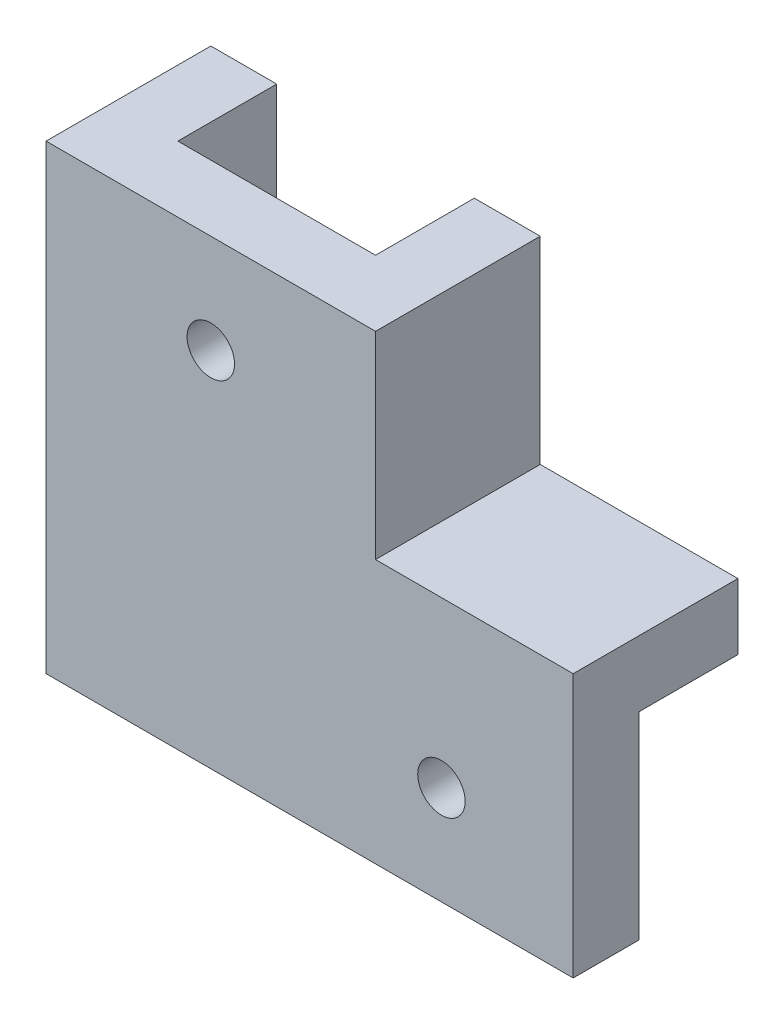
ISO-10303-21;
HEADER;
FILE_DESCRIPTION(('STEP AP214'),'2;1');
FILE_NAME('part.step','',(''),(''),'','','');
FILE_SCHEMA(('AUTOMOTIVE_DESIGN { 1 0 10303 214 1 1 1 1 }'));
ENDSEC;
DATA;
#1=APPLICATION_CONTEXT('core data for automotive mechanical design processes');
#2=APPLICATION_PROTOCOL_DEFINITION('international standard','automotive_design',2000,#1);
#3=PRODUCT_CONTEXT('',#1,'mechanical');
#4=PRODUCT('Part','Part','',(#3));
#5=PRODUCT_RELATED_PRODUCT_CATEGORY('part','',(#4));
#6=PRODUCT_DEFINITION_FORMATION('','',#4);
#7=PRODUCT_DEFINITION_CONTEXT('part definition',#1,'design');
#8=PRODUCT_DEFINITION('design','',#6,#7);
#9=PRODUCT_DEFINITION_SHAPE('','',#8);
#10=(LENGTH_UNIT() NAMED_UNIT(*) SI_UNIT(.MILLI.,.METRE.));
#11=(NAMED_UNIT(*) PLANE_ANGLE_UNIT() SI_UNIT($,.RADIAN.));
#12=(NAMED_UNIT(*) SI_UNIT($,.STERADIAN.) SOLID_ANGLE_UNIT());
#13=UNCERTAINTY_MEASURE_WITH_UNIT(LENGTH_MEASURE(1.E-05),#10,'distance_accuracy_value','');
#14=(GEOMETRIC_REPRESENTATION_CONTEXT(3) GLOBAL_UNCERTAINTY_ASSIGNED_CONTEXT((#13)) GLOBAL_UNIT_ASSIGNED_CONTEXT((#10,
#11,#12)) REPRESENTATION_CONTEXT('',''));
#15=CARTESIAN_POINT('',(0.,0.,0.));
#16=DIRECTION('',(0.,0.,1.));
#17=DIRECTION('',(1.,0.,0.));
#18=AXIS2_PLACEMENT_3D('',#15,#16,#17);
#19=CARTESIAN_POINT('',(7.47011952191236,-10.8067729083665,-7.5));
#20=DIRECTION('',(1.,0.,0.));
#21=DIRECTION('',(0.,1.,0.));
#22=AXIS2_PLACEMENT_3D('',#19,#20,#21);
#23=PLANE('',#22);
#24=DIRECTION('',(0.,1.,0.));
#25=VECTOR('',#24,1.);
#26=CARTESIAN_POINT('',(7.47011952191236,9.19322709163348,0.));
#27=LINE('',#26,#25);
#28=CARTESIAN_POINT('',(7.47011952191236,-10.8067729083665,0.));
#29=VERTEX_POINT('',#28);
#30=CARTESIAN_POINT('',(7.47011952191236,9.19322709163348,0.));
#31=VERTEX_POINT('',#30);
#32=EDGE_CURVE('E180',#29,#31,#27,.T.);
#33=ORIENTED_EDGE('',*,*,#32,.T.);
#34=DIRECTION('',(0.,0.,1.));
#35=VECTOR('',#34,1.);
#36=CARTESIAN_POINT('',(7.47011952191236,9.19322709163348,-7.5));
#37=LINE('',#36,#35);
#38=CARTESIAN_POINT('',(7.47011952191236,9.19322709163348,-7.5));
#39=VERTEX_POINT('',#38);
#40=EDGE_CURVE('E11',#39,#31,#37,.T.);
#41=ORIENTED_EDGE('',*,*,#40,.F.);
#42=DIRECTION('',(0.,1.,0.));
#43=VECTOR('',#42,1.);
#44=CARTESIAN_POINT('',(7.47011952191236,-10.8067729083665,-7.5));
#45=LINE('',#44,#43);
#46=CARTESIAN_POINT('',(7.47011952191236,-10.8067729083665,-7.5));
#47=VERTEX_POINT('',#46);
#48=EDGE_CURVE('E205',#47,#39,#45,.T.);
#49=ORIENTED_EDGE('',*,*,#48,.F.);
#50=DIRECTION('',(0.,0.,1.));
#51=VECTOR('',#50,1.);
#52=CARTESIAN_POINT('',(7.47011952191236,-10.8067729083665,-7.5));
#53=LINE('',#52,#51);
#54=EDGE_CURVE('E221',#47,#29,#53,.T.);
#55=ORIENTED_EDGE('',*,*,#54,.T.);
#56=EDGE_LOOP('',(#33,#41,#49,#55));
#57=FACE_BOUND('',#56,.T.);
#58=ADVANCED_FACE('F39',(#57),#23,.F.);
#59=CARTESIAN_POINT('',(27.4701195219124,-10.8067729083665,-7.5));
#60=DIRECTION('',(0.,1.,0.));
#61=DIRECTION('',(-1.,0.,0.));
#62=AXIS2_PLACEMENT_3D('',#59,#60,#61);
#63=PLANE('',#62);
#64=DIRECTION('',(-1.,0.,0.));
#65=VECTOR('',#64,1.);
#66=CARTESIAN_POINT('',(27.4701195219124,-10.8067729083665,0.));
#67=LINE('',#66,#65);
#68=CARTESIAN_POINT('',(27.4701195219124,-10.8067729083665,0.));
#69=VERTEX_POINT('',#68);
#70=EDGE_CURVE('E176',#69,#29,#67,.T.);
#71=ORIENTED_EDGE('',*,*,#70,.T.);
#72=ORIENTED_EDGE('',*,*,#54,.F.);
#73=DIRECTION('',(-1.,0.,0.));
#74=VECTOR('',#73,1.);
#75=CARTESIAN_POINT('',(27.4701195219124,-10.8067729083665,-7.5));
#76=LINE('',#75,#74);
#77=CARTESIAN_POINT('',(27.4701195219124,-10.8067729083665,-7.5));
#78=VERTEX_POINT('',#77);
#79=EDGE_CURVE('E54',#78,#47,#76,.T.);
#80=ORIENTED_EDGE('',*,*,#79,.F.);
#81=DIRECTION('',(0.,0.,1.));
#82=VECTOR('',#81,1.);
#83=CARTESIAN_POINT('',(27.4701195219124,-10.8067729083665,-7.5));
#84=LINE('',#83,#82);
#85=EDGE_CURVE('E225',#78,#69,#84,.T.);
#86=ORIENTED_EDGE('',*,*,#85,.T.);
#87=EDGE_LOOP('',(#71,#72,#80,#86));
#88=FACE_BOUND('',#87,.T.);
#89=ADVANCED_FACE('F259',(#88),#63,.F.);
#90=CARTESIAN_POINT('',(7.47011952191236,9.19322709163348,-7.5));
#91=DIRECTION('',(0.,-1.,0.));
#92=DIRECTION('',(0.,0.,-1.));
#93=AXIS2_PLACEMENT_3D('',#90,#91,#92);
#94=PLANE('',#93);
#95=ORIENTED_EDGE('',*,*,#40,.T.);
#96=DIRECTION('',(-1.,0.,0.));
#97=VECTOR('',#96,1.);
#98=CARTESIAN_POINT('',(-7.52988047808764,9.19322709163348,0.));
#99=LINE('',#98,#97);
#100=CARTESIAN_POINT('',(-7.52988047808764,9.19322709163348,0.));
#101=VERTEX_POINT('',#100);
#102=EDGE_CURVE('E170',#31,#101,#99,.T.);
#103=ORIENTED_EDGE('',*,*,#102,.T.);
#104=DIRECTION('',(0.,0.,1.));
#105=VECTOR('',#104,1.);
#106=CARTESIAN_POINT('',(-7.52988047808764,9.19322709163348,-7.5));
#107=LINE('',#106,#105);
#108=CARTESIAN_POINT('',(-7.52988047808764,9.19322709163348,-7.5));
#109=VERTEX_POINT('',#108);
#110=EDGE_CURVE('E150',#109,#101,#107,.T.);
#111=ORIENTED_EDGE('',*,*,#110,.F.);
#112=DIRECTION('',(1.,0.,0.));
#113=VECTOR('',#112,1.);
#114=CARTESIAN_POINT('',(-7.52988047808764,9.19322709163348,-7.5));
#115=LINE('',#114,#113);
#116=CARTESIAN_POINT('',(-12.5298804780876,9.19322709163348,-7.5));
#117=VERTEX_POINT('',#116);
#118=EDGE_CURVE('E140',#117,#109,#115,.T.);
#119=ORIENTED_EDGE('',*,*,#118,.F.);
#120=DIRECTION('',(0.,0.,-1.));
#121=VECTOR('',#120,1.);
#122=CARTESIAN_POINT('',(-12.5298804780876,9.19322709163348,5.));
#123=LINE('',#122,#121);
#124=CARTESIAN_POINT('',(-12.5298804780876,9.19322709163348,5.));
#125=VERTEX_POINT('',#124);
#126=EDGE_CURVE('E155',#125,#117,#123,.T.);
#127=ORIENTED_EDGE('',*,*,#126,.F.);
#128=DIRECTION('',(-1.,0.,0.));
#129=VECTOR('',#128,1.);
#130=CARTESIAN_POINT('',(12.4701195219124,9.19322709163348,5.));
#131=LINE('',#130,#129);
#132=CARTESIAN_POINT('',(12.4701195219124,9.19322709163348,5.));
#133=VERTEX_POINT('',#132);
#134=EDGE_CURVE('E190',#133,#125,#131,.T.);
#135=ORIENTED_EDGE('',*,*,#134,.F.);
#136=DIRECTION('',(0.,0.,1.));
#137=VECTOR('',#136,1.);
#138=CARTESIAN_POINT('',(12.4701195219124,9.19322709163348,-7.5));
#139=LINE('',#138,#137);
#140=CARTESIAN_POINT('',(12.4701195219124,9.19322709163348,-7.5));
#141=VERTEX_POINT('',#140);
#142=EDGE_CURVE('E47',#141,#133,#139,.T.);
#143=ORIENTED_EDGE('',*,*,#142,.F.);
#144=DIRECTION('',(1.,0.,0.));
#145=VECTOR('',#144,1.);
#146=CARTESIAN_POINT('',(7.47011952191236,9.19322709163348,-7.5));
#147=LINE('',#146,#145);
#148=EDGE_CURVE('E208',#39,#141,#147,.T.);
#149=ORIENTED_EDGE('',*,*,#148,.F.);
#150=EDGE_LOOP('',(#95,#103,#111,#119,#127,#135,#143,#149));
#151=FACE_BOUND('',#150,.T.);
#152=ADVANCED_FACE('F247',(#151),#94,.F.);
#153=CARTESIAN_POINT('',(12.4701195219124,9.19322709163348,-7.5));
#154=DIRECTION('',(-1.,0.,0.));
#155=DIRECTION('',(0.,-1.,0.));
#156=AXIS2_PLACEMENT_3D('',#153,#154,#155);
#157=PLANE('',#156);
#158=ORIENTED_EDGE('',*,*,#142,.T.);
#159=DIRECTION('',(0.,1.,0.));
#160=VECTOR('',#159,1.);
#161=CARTESIAN_POINT('',(12.4701195219124,-5.80677290836653,5.));
#162=LINE('',#161,#160);
#163=CARTESIAN_POINT('',(12.4701195219124,-5.80677290836653,5.));
#164=VERTEX_POINT('',#163);
#165=EDGE_CURVE('E201',#164,#133,#162,.T.);
#166=ORIENTED_EDGE('',*,*,#165,.F.);
#167=DIRECTION('',(0.,0.,1.));
#168=VECTOR('',#167,1.);
#169=CARTESIAN_POINT('',(12.4701195219124,-5.80677290836653,-7.5));
#170=LINE('',#169,#168);
#171=CARTESIAN_POINT('',(12.4701195219124,-5.80677290836653,-7.5));
#172=VERTEX_POINT('',#171);
#173=EDGE_CURVE('E232',#172,#164,#170,.T.);
#174=ORIENTED_EDGE('',*,*,#173,.F.);
#175=DIRECTION('',(0.,-1.,0.));
#176=VECTOR('',#175,1.);
#177=CARTESIAN_POINT('',(12.4701195219124,9.19322709163348,-7.5));
#178=LINE('',#177,#176);
#179=EDGE_CURVE('E211',#141,#172,#178,.T.);
#180=ORIENTED_EDGE('',*,*,#179,.F.);
#181=EDGE_LOOP('',(#158,#166,#174,#180));
#182=FACE_BOUND('',#181,.T.);
#183=ADVANCED_FACE('F239',(#182),#157,.F.);
#184=CARTESIAN_POINT('',(12.4701195219124,-5.80677290836653,-7.5));
#185=DIRECTION('',(0.,-1.,0.));
#186=DIRECTION('',(1.,0.,0.));
#187=AXIS2_PLACEMENT_3D('',#184,#185,#186);
#188=PLANE('',#187);
#189=ORIENTED_EDGE('',*,*,#173,.T.);
#190=DIRECTION('',(-1.,0.,0.));
#191=VECTOR('',#190,1.);
#192=CARTESIAN_POINT('',(27.4701195219124,-5.80677290836653,5.));
#193=LINE('',#192,#191);
#194=CARTESIAN_POINT('',(27.4701195219124,-5.80677290836653,5.));
#195=VERTEX_POINT('',#194);
#196=EDGE_CURVE('E197',#195,#164,#193,.T.);
#197=ORIENTED_EDGE('',*,*,#196,.F.);
#198=DIRECTION('',(0.,0.,1.));
#199=VECTOR('',#198,1.);
#200=CARTESIAN_POINT('',(27.4701195219124,-5.80677290836653,-7.5));
#201=LINE('',#200,#199);
#202=CARTESIAN_POINT('',(27.4701195219124,-5.80677290836653,-7.5));
#203=VERTEX_POINT('',#202);
#204=EDGE_CURVE('E229',#203,#195,#201,.T.);
#205=ORIENTED_EDGE('',*,*,#204,.F.);
#206=DIRECTION('',(1.,0.,0.));
#207=VECTOR('',#206,1.);
#208=CARTESIAN_POINT('',(12.4701195219124,-5.80677290836653,-7.5));
#209=LINE('',#208,#207);
#210=EDGE_CURVE('E214',#172,#203,#209,.T.);
#211=ORIENTED_EDGE('',*,*,#210,.F.);
#212=EDGE_LOOP('',(#189,#197,#205,#211));
#213=FACE_BOUND('',#212,.T.);
#214=ADVANCED_FACE('F263',(#213),#188,.F.);
#215=CARTESIAN_POINT('',(27.4701195219124,-10.8067729083665,-7.5));
#216=DIRECTION('',(-1.,0.,0.));
#217=DIRECTION('',(0.,0.,1.));
#218=AXIS2_PLACEMENT_3D('',#215,#216,#217);
#219=PLANE('',#218);
#220=ORIENTED_EDGE('',*,*,#204,.T.);
#221=DIRECTION('',(0.,1.,0.));
#222=VECTOR('',#221,1.);
#223=CARTESIAN_POINT('',(27.4701195219124,-10.8067729083665,5.));
#224=LINE('',#223,#222);
#225=CARTESIAN_POINT('',(27.4701195219124,-25.8067729083665,5.));
#226=VERTEX_POINT('',#225);
#227=EDGE_CURVE('E193',#226,#195,#224,.T.);
#228=ORIENTED_EDGE('',*,*,#227,.F.);
#229=DIRECTION('',(0.,0.,-1.));
#230=VECTOR('',#229,1.);
#231=CARTESIAN_POINT('',(27.4701195219124,-25.8067729083665,5.));
#232=LINE('',#231,#230);
#233=CARTESIAN_POINT('',(27.4701195219124,-25.8067729083665,0.));
#234=VERTEX_POINT('',#233);
#235=EDGE_CURVE('E169',#226,#234,#232,.T.);
#236=ORIENTED_EDGE('',*,*,#235,.T.);
#237=DIRECTION('',(0.,1.,0.));
#238=VECTOR('',#237,1.);
#239=CARTESIAN_POINT('',(27.4701195219124,-25.8067729083665,0.));
#240=LINE('',#239,#238);
#241=EDGE_CURVE('E173',#234,#69,#240,.T.);
#242=ORIENTED_EDGE('',*,*,#241,.T.);
#243=ORIENTED_EDGE('',*,*,#85,.F.);
#244=DIRECTION('',(0.,-1.,0.));
#245=VECTOR('',#244,1.);
#246=CARTESIAN_POINT('',(27.4701195219124,-10.8067729083665,-7.5));
#247=LINE('',#246,#245);
#248=EDGE_CURVE('E59',#203,#78,#247,.T.);
#249=ORIENTED_EDGE('',*,*,#248,.F.);
#250=EDGE_LOOP('',(#220,#228,#236,#242,#243,#249));
#251=FACE_BOUND('',#250,.T.);
#252=ADVANCED_FACE('F254',(#251),#219,.F.);
#253=CARTESIAN_POINT('',(0.,0.,-7.5));
#254=DIRECTION('',(0.,0.,-1.));
#255=DIRECTION('',(-1.,0.,0.));
#256=AXIS2_PLACEMENT_3D('',#253,#254,#255);
#257=PLANE('',#256);
#258=ORIENTED_EDGE('',*,*,#48,.T.);
#259=ORIENTED_EDGE('',*,*,#148,.T.);
#260=ORIENTED_EDGE('',*,*,#179,.T.);
#261=ORIENTED_EDGE('',*,*,#210,.T.);
#262=ORIENTED_EDGE('',*,*,#248,.T.);
#263=ORIENTED_EDGE('',*,*,#79,.T.);
#264=EDGE_LOOP('',(#258,#259,#260,#261,#262,#263));
#265=FACE_BOUND('',#264,.T.);
#266=ADVANCED_FACE('F264',(#265),#257,.T.);
#267=CARTESIAN_POINT('',(0.,0.,5.));
#268=DIRECTION('',(0.,0.,1.));
#269=DIRECTION('',(1.,0.,0.));
#270=AXIS2_PLACEMENT_3D('',#267,#268,#269);
#271=PLANE('',#270);
#272=CARTESIAN_POINT('',(-0.0298804780876445,1.69322709163348,5.));
#273=DIRECTION('',(0.,0.,-1.));
#274=DIRECTION('',(-1.,0.,0.));
#275=AXIS2_PLACEMENT_3D('',#272,#273,#274);
#276=CIRCLE('',#275,1.8);
#277=CARTESIAN_POINT('',(-1.82988047808764,1.69322709163348,5.));
#278=VERTEX_POINT('',#277);
#279=EDGE_CURVE('E443',#278,#278,#276,.T.);
#280=ORIENTED_EDGE('',*,*,#279,.T.);
#281=EDGE_LOOP('',(#280));
#282=FACE_BOUND('',#281,.T.);
#283=CARTESIAN_POINT('',(17.4701195219124,-18.3067729083665,5.));
#284=DIRECTION('',(0.,0.,-1.));
#285=DIRECTION('',(-1.,0.,0.));
#286=AXIS2_PLACEMENT_3D('',#283,#284,#285);
#287=CIRCLE('',#286,1.8);
#288=CARTESIAN_POINT('',(15.6701195219124,-18.3067729083665,5.));
#289=VERTEX_POINT('',#288);
#290=EDGE_CURVE('E448',#289,#289,#287,.T.);
#291=ORIENTED_EDGE('',*,*,#290,.T.);
#292=EDGE_LOOP('',(#291));
#293=FACE_BOUND('',#292,.T.);
#294=DIRECTION('',(1.,0.,0.));
#295=VECTOR('',#294,1.);
#296=CARTESIAN_POINT('',(-7.52988047808764,-25.8067729083665,5.));
#297=LINE('',#296,#295);
#298=CARTESIAN_POINT('',(-12.5298804780876,-25.8067729083665,5.));
#299=VERTEX_POINT('',#298);
#300=EDGE_CURVE('E165',#299,#226,#297,.T.);
#301=ORIENTED_EDGE('',*,*,#300,.T.);
#302=ORIENTED_EDGE('',*,*,#227,.T.);
#303=ORIENTED_EDGE('',*,*,#196,.T.);
#304=ORIENTED_EDGE('',*,*,#165,.T.);
#305=ORIENTED_EDGE('',*,*,#134,.T.);
#306=DIRECTION('',(0.,-1.,0.));
#307=VECTOR('',#306,1.);
#308=CARTESIAN_POINT('',(-12.5298804780876,9.19322709163348,5.));
#309=LINE('',#308,#307);
#310=EDGE_CURVE('E149',#125,#299,#309,.T.);
#311=ORIENTED_EDGE('',*,*,#310,.T.);
#312=EDGE_LOOP('',(#301,#302,#303,#304,#305,#311));
#313=FACE_BOUND('',#312,.T.);
#314=ADVANCED_FACE('F244',(#282,#293,#313),#271,.T.);
#315=CARTESIAN_POINT('',(0.,0.,0.));
#316=DIRECTION('',(0.,0.,1.));
#317=DIRECTION('',(1.,0.,0.));
#318=AXIS2_PLACEMENT_3D('',#315,#316,#317);
#319=PLANE('',#318);
#320=CARTESIAN_POINT('',(-0.0298804780876445,1.69322709163348,0.));
#321=DIRECTION('',(0.,0.,-1.));
#322=DIRECTION('',(-1.,0.,0.));
#323=AXIS2_PLACEMENT_3D('',#320,#321,#322);
#324=CIRCLE('',#323,1.8);
#325=CARTESIAN_POINT('',(-1.82988047808764,1.69322709163348,0.));
#326=VERTEX_POINT('',#325);
#327=EDGE_CURVE('E446',#326,#326,#324,.T.);
#328=ORIENTED_EDGE('',*,*,#327,.F.);
#329=EDGE_LOOP('',(#328));
#330=FACE_BOUND('',#329,.T.);
#331=CARTESIAN_POINT('',(17.4701195219124,-18.3067729083665,0.));
#332=DIRECTION('',(0.,0.,-1.));
#333=DIRECTION('',(-1.,0.,0.));
#334=AXIS2_PLACEMENT_3D('',#331,#332,#333);
#335=CIRCLE('',#334,1.8);
#336=CARTESIAN_POINT('',(15.6701195219124,-18.3067729083665,0.));
#337=VERTEX_POINT('',#336);
#338=EDGE_CURVE('E454',#337,#337,#335,.T.);
#339=ORIENTED_EDGE('',*,*,#338,.F.);
#340=EDGE_LOOP('',(#339));
#341=FACE_BOUND('',#340,.T.);
#342=DIRECTION('',(0.,-1.,0.));
#343=VECTOR('',#342,1.);
#344=CARTESIAN_POINT('',(-7.52988047808764,-25.8067729083665,0.));
#345=LINE('',#344,#343);
#346=CARTESIAN_POINT('',(-7.52988047808764,-25.8067729083665,0.));
#347=VERTEX_POINT('',#346);
#348=EDGE_CURVE('E145',#101,#347,#345,.T.);
#349=ORIENTED_EDGE('',*,*,#348,.F.);
#350=ORIENTED_EDGE('',*,*,#102,.F.);
#351=ORIENTED_EDGE('',*,*,#32,.F.);
#352=ORIENTED_EDGE('',*,*,#70,.F.);
#353=ORIENTED_EDGE('',*,*,#241,.F.);
#354=DIRECTION('',(1.,0.,0.));
#355=VECTOR('',#354,1.);
#356=CARTESIAN_POINT('',(-7.52988047808764,-25.8067729083665,0.));
#357=LINE('',#356,#355);
#358=EDGE_CURVE('E164',#347,#234,#357,.T.);
#359=ORIENTED_EDGE('',*,*,#358,.F.);
#360=EDGE_LOOP('',(#349,#350,#351,#352,#353,#359));
#361=FACE_BOUND('',#360,.T.);
#362=ADVANCED_FACE('F257',(#330,#341,#361),#319,.F.);
#363=CARTESIAN_POINT('',(-7.52988047808764,-25.8067729083665,5.));
#364=DIRECTION('',(0.,1.,0.));
#365=DIRECTION('',(0.,0.,1.));
#366=AXIS2_PLACEMENT_3D('',#363,#364,#365);
#367=PLANE('',#366);
#368=DIRECTION('',(0.,0.,-1.));
#369=VECTOR('',#368,1.);
#370=CARTESIAN_POINT('',(-12.5298804780876,-25.8067729083665,5.));
#371=LINE('',#370,#369);
#372=CARTESIAN_POINT('',(-12.5298804780876,-25.8067729083665,-7.5));
#373=VERTEX_POINT('',#372);
#374=EDGE_CURVE('E129',#299,#373,#371,.T.);
#375=ORIENTED_EDGE('',*,*,#374,.T.);
#376=DIRECTION('',(-1.,0.,0.));
#377=VECTOR('',#376,1.);
#378=CARTESIAN_POINT('',(-7.52988047808764,-25.8067729083665,-7.5));
#379=LINE('',#378,#377);
#380=CARTESIAN_POINT('',(-7.52988047808764,-25.8067729083665,-7.5));
#381=VERTEX_POINT('',#380);
#382=EDGE_CURVE('E122',#381,#373,#379,.T.);
#383=ORIENTED_EDGE('',*,*,#382,.F.);
#384=DIRECTION('',(0.,0.,1.));
#385=VECTOR('',#384,1.);
#386=CARTESIAN_POINT('',(-7.52988047808764,-25.8067729083665,-7.5));
#387=LINE('',#386,#385);
#388=EDGE_CURVE('E126',#381,#347,#387,.T.);
#389=ORIENTED_EDGE('',*,*,#388,.T.);
#390=ORIENTED_EDGE('',*,*,#358,.T.);
#391=ORIENTED_EDGE('',*,*,#235,.F.);
#392=ORIENTED_EDGE('',*,*,#300,.F.);
#393=EDGE_LOOP('',(#375,#383,#389,#390,#391,#392));
#394=FACE_BOUND('',#393,.T.);
#395=ADVANCED_FACE('F124',(#394),#367,.F.);
#396=CARTESIAN_POINT('',(-12.5298804780876,9.19322709163348,5.));
#397=DIRECTION('',(1.,0.,0.));
#398=DIRECTION('',(0.,1.,0.));
#399=AXIS2_PLACEMENT_3D('',#396,#397,#398);
#400=PLANE('',#399);
#401=ORIENTED_EDGE('',*,*,#126,.T.);
#402=DIRECTION('',(0.,1.,0.));
#403=VECTOR('',#402,1.);
#404=CARTESIAN_POINT('',(-12.5298804780876,-25.8067729083665,-7.5));
#405=LINE('',#404,#403);
#406=EDGE_CURVE('E134',#373,#117,#405,.T.);
#407=ORIENTED_EDGE('',*,*,#406,.F.);
#408=ORIENTED_EDGE('',*,*,#374,.F.);
#409=ORIENTED_EDGE('',*,*,#310,.F.);
#410=EDGE_LOOP('',(#401,#407,#408,#409));
#411=FACE_BOUND('',#410,.T.);
#412=ADVANCED_FACE('F250',(#411),#400,.F.);
#413=CARTESIAN_POINT('',(-7.52988047808764,-25.8067729083665,-7.5));
#414=DIRECTION('',(-1.,0.,0.));
#415=DIRECTION('',(0.,-1.,0.));
#416=AXIS2_PLACEMENT_3D('',#413,#414,#415);
#417=PLANE('',#416);
#418=ORIENTED_EDGE('',*,*,#348,.T.);
#419=ORIENTED_EDGE('',*,*,#388,.F.);
#420=DIRECTION('',(0.,-1.,0.));
#421=VECTOR('',#420,1.);
#422=CARTESIAN_POINT('',(-7.52988047808764,-25.8067729083665,-7.5));
#423=LINE('',#422,#421);
#424=EDGE_CURVE('E135',#109,#381,#423,.T.);
#425=ORIENTED_EDGE('',*,*,#424,.F.);
#426=ORIENTED_EDGE('',*,*,#110,.T.);
#427=EDGE_LOOP('',(#418,#419,#425,#426));
#428=FACE_BOUND('',#427,.T.);
#429=ADVANCED_FACE('F147',(#428),#417,.F.);
#430=CARTESIAN_POINT('',(0.,0.,-7.5));
#431=DIRECTION('',(0.,0.,1.));
#432=DIRECTION('',(1.,0.,0.));
#433=AXIS2_PLACEMENT_3D('',#430,#431,#432);
#434=PLANE('',#433);
#435=ORIENTED_EDGE('',*,*,#424,.T.);
#436=ORIENTED_EDGE('',*,*,#382,.T.);
#437=ORIENTED_EDGE('',*,*,#406,.T.);
#438=ORIENTED_EDGE('',*,*,#118,.T.);
#439=EDGE_LOOP('',(#435,#436,#437,#438));
#440=FACE_BOUND('',#439,.T.);
#441=ADVANCED_FACE('F138',(#440),#434,.F.);
#442=CARTESIAN_POINT('',(17.4701195219124,-18.3067729083665,5.));
#443=DIRECTION('',(0.,0.,-1.));
#444=DIRECTION('',(-1.,0.,0.));
#445=AXIS2_PLACEMENT_3D('',#442,#443,#444);
#446=CYLINDRICAL_SURFACE('',#445,1.8);
#447=ORIENTED_EDGE('',*,*,#290,.F.);
#448=EDGE_LOOP('',(#447));
#449=FACE_BOUND('',#448,.T.);
#450=ORIENTED_EDGE('',*,*,#338,.T.);
#451=EDGE_LOOP('',(#450));
#452=FACE_BOUND('',#451,.T.);
#453=ADVANCED_FACE('F339',(#449,#452),#446,.F.);
#454=CARTESIAN_POINT('',(-0.0298804780876445,1.69322709163348,5.));
#455=DIRECTION('',(0.,0.,-1.));
#456=DIRECTION('',(-1.,0.,0.));
#457=AXIS2_PLACEMENT_3D('',#454,#455,#456);
#458=CYLINDRICAL_SURFACE('',#457,1.8);
#459=ORIENTED_EDGE('',*,*,#279,.F.);
#460=EDGE_LOOP('',(#459));
#461=FACE_BOUND('',#460,.T.);
#462=ORIENTED_EDGE('',*,*,#327,.T.);
#463=EDGE_LOOP('',(#462));
#464=FACE_BOUND('',#463,.T.);
#465=ADVANCED_FACE('F345',(#461,#464),#458,.F.);
#466=CLOSED_SHELL('',(#58,#89,#152,#183,#214,#252,#266,#314,#362,#395,#412,#429,#441,#453,#465));
#467=MANIFOLD_SOLID_BREP('B2',#466);
#468=ADVANCED_BREP_SHAPE_REPRESENTATION('',(#18,#467),#14);
#469=SHAPE_DEFINITION_REPRESENTATION(#9,#468);
ENDSEC;
END-ISO-10303-21;
